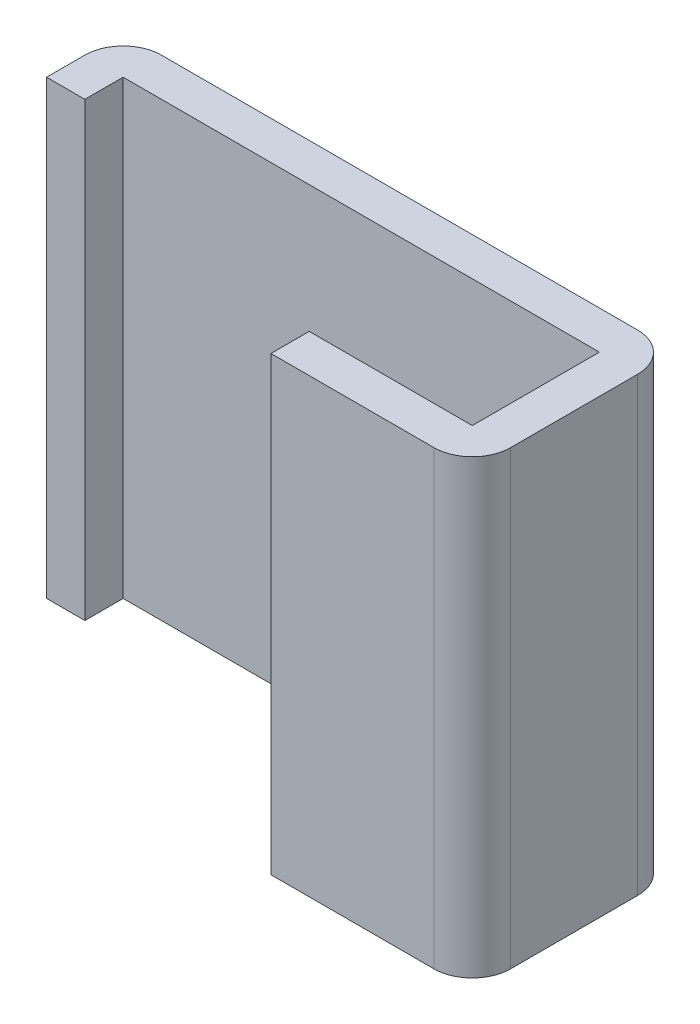
ISO-10303-21;
HEADER;
FILE_DESCRIPTION(('STEP AP214'),'2;1');
FILE_NAME('part.step','',(''),(''),'','','');
FILE_SCHEMA(('AUTOMOTIVE_DESIGN { 1 0 10303 214 1 1 1 1 }'));
ENDSEC;
DATA;
#1=APPLICATION_CONTEXT('core data for automotive mechanical design processes');
#2=APPLICATION_PROTOCOL_DEFINITION('international standard','automotive_design',2000,#1);
#3=PRODUCT_CONTEXT('',#1,'mechanical');
#4=PRODUCT('Part','Part','',(#3));
#5=PRODUCT_RELATED_PRODUCT_CATEGORY('part','',(#4));
#6=PRODUCT_DEFINITION_FORMATION('','',#4);
#7=PRODUCT_DEFINITION_CONTEXT('part definition',#1,'design');
#8=PRODUCT_DEFINITION('design','',#6,#7);
#9=PRODUCT_DEFINITION_SHAPE('','',#8);
#10=(LENGTH_UNIT() NAMED_UNIT(*) SI_UNIT(.MILLI.,.METRE.));
#11=(NAMED_UNIT(*) PLANE_ANGLE_UNIT() SI_UNIT($,.RADIAN.));
#12=(NAMED_UNIT(*) SI_UNIT($,.STERADIAN.) SOLID_ANGLE_UNIT());
#13=UNCERTAINTY_MEASURE_WITH_UNIT(LENGTH_MEASURE(1.E-05),#10,'distance_accuracy_value','');
#14=(GEOMETRIC_REPRESENTATION_CONTEXT(3) GLOBAL_UNCERTAINTY_ASSIGNED_CONTEXT((#13)) GLOBAL_UNIT_ASSIGNED_CONTEXT((#10,
#11,#12)) REPRESENTATION_CONTEXT('',''));
#15=CARTESIAN_POINT('',(0.,0.,0.));
#16=DIRECTION('',(0.,0.,1.));
#17=DIRECTION('',(1.,0.,0.));
#18=AXIS2_PLACEMENT_3D('',#15,#16,#17);
#19=CARTESIAN_POINT('',(0.49,-9.094,1.08));
#20=DIRECTION('',(1.,0.,0.));
#21=DIRECTION('',(0.,0.,-1.));
#22=AXIS2_PLACEMENT_3D('',#19,#20,#21);
#23=PLANE('',#22);
#24=DIRECTION('',(0.,1.,0.));
#25=VECTOR('',#24,1.);
#26=CARTESIAN_POINT('',(0.49,-9.094,1.33));
#27=LINE('',#26,#25);
#28=CARTESIAN_POINT('',(0.49,-6.146,1.33));
#29=VERTEX_POINT('',#28);
#30=CARTESIAN_POINT('',(0.49,-9.094,1.33));
#31=VERTEX_POINT('',#30);
#32=EDGE_CURVE('E98',#29,#31,#27,.F.);
#33=ORIENTED_EDGE('',*,*,#32,.F.);
#34=DIRECTION('',(0.,0.,-1.));
#35=VECTOR('',#34,1.);
#36=CARTESIAN_POINT('',(0.49,-6.146,1.08));
#37=LINE('',#36,#35);
#38=CARTESIAN_POINT('',(0.49,-6.146,1.08));
#39=VERTEX_POINT('',#38);
#40=EDGE_CURVE('E103',#39,#29,#37,.F.);
#41=ORIENTED_EDGE('',*,*,#40,.F.);
#42=DIRECTION('',(0.,1.,0.));
#43=VECTOR('',#42,1.);
#44=CARTESIAN_POINT('',(0.49,-9.094,1.08));
#45=LINE('',#44,#43);
#46=CARTESIAN_POINT('',(0.49,-9.094,1.08));
#47=VERTEX_POINT('',#46);
#48=EDGE_CURVE('E127',#39,#47,#45,.F.);
#49=ORIENTED_EDGE('',*,*,#48,.T.);
#50=DIRECTION('',(0.,0.,-1.));
#51=VECTOR('',#50,1.);
#52=CARTESIAN_POINT('',(0.49,-9.094,1.08));
#53=LINE('',#52,#51);
#54=EDGE_CURVE('E84',#31,#47,#53,.T.);
#55=ORIENTED_EDGE('',*,*,#54,.F.);
#56=EDGE_LOOP('',(#33,#41,#49,#55));
#57=FACE_BOUND('',#56,.T.);
#58=ADVANCED_FACE('F17',(#57),#23,.F.);
#59=CARTESIAN_POINT('',(1.555,-9.094,1.33));
#60=DIRECTION('',(0.,0.,1.));
#61=DIRECTION('',(1.,0.,0.));
#62=AXIS2_PLACEMENT_3D('',#59,#60,#61);
#63=PLANE('',#62);
#64=ORIENTED_EDGE('',*,*,#32,.T.);
#65=DIRECTION('',(1.,0.,0.));
#66=VECTOR('',#65,1.);
#67=CARTESIAN_POINT('',(1.555,-9.094,1.33));
#68=LINE('',#67,#66);
#69=CARTESIAN_POINT('',(1.555,-9.094,1.33));
#70=VERTEX_POINT('',#69);
#71=EDGE_CURVE('E78',#31,#70,#68,.T.);
#72=ORIENTED_EDGE('',*,*,#71,.T.);
#73=DIRECTION('',(0.,-1.,0.));
#74=VECTOR('',#73,1.);
#75=CARTESIAN_POINT('',(1.555,-9.094,1.33));
#76=LINE('',#75,#74);
#77=CARTESIAN_POINT('',(1.555,-6.146,1.33));
#78=VERTEX_POINT('',#77);
#79=EDGE_CURVE('E99',#78,#70,#76,.T.);
#80=ORIENTED_EDGE('',*,*,#79,.F.);
#81=DIRECTION('',(1.,0.,0.));
#82=VECTOR('',#81,1.);
#83=CARTESIAN_POINT('',(1.555,-6.146,1.33));
#84=LINE('',#83,#82);
#85=EDGE_CURVE('E94',#78,#29,#84,.F.);
#86=ORIENTED_EDGE('',*,*,#85,.T.);
#87=EDGE_LOOP('',(#64,#72,#80,#86));
#88=FACE_BOUND('',#87,.T.);
#89=ADVANCED_FACE('F96',(#88),#63,.T.);
#90=CARTESIAN_POINT('',(1.555,-9.094,1.08));
#91=DIRECTION('',(0.,0.,1.));
#92=DIRECTION('',(1.,0.,0.));
#93=AXIS2_PLACEMENT_3D('',#90,#91,#92);
#94=PLANE('',#93);
#95=ORIENTED_EDGE('',*,*,#48,.F.);
#96=DIRECTION('',(1.,0.,0.));
#97=VECTOR('',#96,1.);
#98=CARTESIAN_POINT('',(1.555,-6.146,1.08));
#99=LINE('',#98,#97);
#100=CARTESIAN_POINT('',(1.555,-6.146,1.08));
#101=VERTEX_POINT('',#100);
#102=EDGE_CURVE('E108',#101,#39,#99,.F.);
#103=ORIENTED_EDGE('',*,*,#102,.F.);
#104=DIRECTION('',(0.,1.,0.));
#105=VECTOR('',#104,1.);
#106=CARTESIAN_POINT('',(1.555,-9.094,1.08));
#107=LINE('',#106,#105);
#108=CARTESIAN_POINT('',(1.555,-9.094,1.08));
#109=VERTEX_POINT('',#108);
#110=EDGE_CURVE('E181',#101,#109,#107,.F.);
#111=ORIENTED_EDGE('',*,*,#110,.T.);
#112=DIRECTION('',(1.,0.,0.));
#113=VECTOR('',#112,1.);
#114=CARTESIAN_POINT('',(1.555,-9.094,1.08));
#115=LINE('',#114,#113);
#116=EDGE_CURVE('E125',#47,#109,#115,.T.);
#117=ORIENTED_EDGE('',*,*,#116,.F.);
#118=EDGE_LOOP('',(#95,#103,#111,#117));
#119=FACE_BOUND('',#118,.T.);
#120=ADVANCED_FACE('F379',(#119),#94,.F.);
#121=CARTESIAN_POINT('',(1.555,-9.094,1.08));
#122=DIRECTION('',(0.,-1.,0.));
#123=DIRECTION('',(0.,0.,-1.));
#124=AXIS2_PLACEMENT_3D('',#121,#122,#123);
#125=CYLINDRICAL_SURFACE('',#124,0.25);
#126=CARTESIAN_POINT('',(1.555,-6.146,1.08));
#127=DIRECTION('',(0.,-1.,0.));
#128=DIRECTION('',(0.,0.,-1.));
#129=AXIS2_PLACEMENT_3D('',#126,#127,#128);
#130=CIRCLE('',#129,0.25);
#131=CARTESIAN_POINT('',(1.805,-6.146,1.08));
#132=VERTEX_POINT('',#131);
#133=EDGE_CURVE('E147',#132,#78,#130,.T.);
#134=ORIENTED_EDGE('',*,*,#133,.T.);
#135=ORIENTED_EDGE('',*,*,#79,.T.);
#136=CARTESIAN_POINT('',(1.555,-9.094,1.08));
#137=DIRECTION('',(0.,-1.,0.));
#138=DIRECTION('',(0.,0.,-1.));
#139=AXIS2_PLACEMENT_3D('',#136,#137,#138);
#140=CIRCLE('',#139,0.25);
#141=CARTESIAN_POINT('',(1.805,-9.094,1.08));
#142=VERTEX_POINT('',#141);
#143=EDGE_CURVE('E20',#70,#142,#140,.F.);
#144=ORIENTED_EDGE('',*,*,#143,.T.);
#145=DIRECTION('',(0.,1.,0.));
#146=VECTOR('',#145,1.);
#147=CARTESIAN_POINT('',(1.805,-9.094,1.08));
#148=LINE('',#147,#146);
#149=EDGE_CURVE('E156',#142,#132,#148,.T.);
#150=ORIENTED_EDGE('',*,*,#149,.T.);
#151=EDGE_LOOP('',(#134,#135,#144,#150));
#152=FACE_BOUND('',#151,.T.);
#153=ADVANCED_FACE('F155',(#152),#125,.T.);
#154=CARTESIAN_POINT('',(-1.805,-9.094,0.5));
#155=DIRECTION('',(0.,0.,-1.));
#156=DIRECTION('',(-1.,0.,0.));
#157=AXIS2_PLACEMENT_3D('',#154,#155,#156);
#158=PLANE('',#157);
#159=DIRECTION('',(0.,1.,0.));
#160=VECTOR('',#159,1.);
#161=CARTESIAN_POINT('',(-1.555,-9.094,0.5));
#162=LINE('',#161,#160);
#163=CARTESIAN_POINT('',(-1.555,-9.094,0.5));
#164=VERTEX_POINT('',#163);
#165=CARTESIAN_POINT('',(-1.555,-6.146,0.5));
#166=VERTEX_POINT('',#165);
#167=EDGE_CURVE('E194',#164,#166,#162,.T.);
#168=ORIENTED_EDGE('',*,*,#167,.T.);
#169=DIRECTION('',(-1.,0.,0.));
#170=VECTOR('',#169,1.);
#171=CARTESIAN_POINT('',(-1.805,-6.146,0.5));
#172=LINE('',#171,#170);
#173=CARTESIAN_POINT('',(-1.805,-6.146,0.5));
#174=VERTEX_POINT('',#173);
#175=EDGE_CURVE('E150',#174,#166,#172,.F.);
#176=ORIENTED_EDGE('',*,*,#175,.F.);
#177=DIRECTION('',(0.,1.,0.));
#178=VECTOR('',#177,1.);
#179=CARTESIAN_POINT('',(-1.805,-9.094,0.5));
#180=LINE('',#179,#178);
#181=CARTESIAN_POINT('',(-1.805,-9.094,0.5));
#182=VERTEX_POINT('',#181);
#183=EDGE_CURVE('E171',#174,#182,#180,.F.);
#184=ORIENTED_EDGE('',*,*,#183,.T.);
#185=DIRECTION('',(-1.,0.,0.));
#186=VECTOR('',#185,1.);
#187=CARTESIAN_POINT('',(-1.805,-9.094,0.5));
#188=LINE('',#187,#186);
#189=EDGE_CURVE('E189',#164,#182,#188,.T.);
#190=ORIENTED_EDGE('',*,*,#189,.F.);
#191=EDGE_LOOP('',(#168,#176,#184,#190));
#192=FACE_BOUND('',#191,.T.);
#193=ADVANCED_FACE('F278',(#192),#158,.F.);
#194=CARTESIAN_POINT('',(-1.555,-9.094,0.5));
#195=DIRECTION('',(-1.,0.,0.));
#196=DIRECTION('',(0.,0.,1.));
#197=AXIS2_PLACEMENT_3D('',#194,#195,#196);
#198=PLANE('',#197);
#199=DIRECTION('',(0.,1.,0.));
#200=VECTOR('',#199,1.);
#201=CARTESIAN_POINT('',(-1.555,-9.094,0.25));
#202=LINE('',#201,#200);
#203=CARTESIAN_POINT('',(-1.555,-9.094,0.25));
#204=VERTEX_POINT('',#203);
#205=CARTESIAN_POINT('',(-1.555,-6.146,0.25));
#206=VERTEX_POINT('',#205);
#207=EDGE_CURVE('E222',#204,#206,#202,.T.);
#208=ORIENTED_EDGE('',*,*,#207,.T.);
#209=DIRECTION('',(0.,0.,1.));
#210=VECTOR('',#209,1.);
#211=CARTESIAN_POINT('',(-1.555,-6.146,0.5));
#212=LINE('',#211,#210);
#213=EDGE_CURVE('E199',#166,#206,#212,.F.);
#214=ORIENTED_EDGE('',*,*,#213,.F.);
#215=ORIENTED_EDGE('',*,*,#167,.F.);
#216=DIRECTION('',(0.,0.,1.));
#217=VECTOR('',#216,1.);
#218=CARTESIAN_POINT('',(-1.555,-9.094,0.5));
#219=LINE('',#218,#217);
#220=EDGE_CURVE('E186',#204,#164,#219,.T.);
#221=ORIENTED_EDGE('',*,*,#220,.F.);
#222=EDGE_LOOP('',(#208,#214,#215,#221));
#223=FACE_BOUND('',#222,.T.);
#224=ADVANCED_FACE('F223',(#223),#198,.F.);
#225=CARTESIAN_POINT('',(1.555,-9.094,0.25));
#226=DIRECTION('',(1.,0.,0.));
#227=DIRECTION('',(0.,0.,-1.));
#228=AXIS2_PLACEMENT_3D('',#225,#226,#227);
#229=PLANE('',#228);
#230=ORIENTED_EDGE('',*,*,#110,.F.);
#231=DIRECTION('',(0.,0.,-1.));
#232=VECTOR('',#231,1.);
#233=CARTESIAN_POINT('',(1.555,-6.146,0.25));
#234=LINE('',#233,#232);
#235=CARTESIAN_POINT('',(1.555,-6.146,0.25));
#236=VERTEX_POINT('',#235);
#237=EDGE_CURVE('E184',#236,#101,#234,.F.);
#238=ORIENTED_EDGE('',*,*,#237,.F.);
#239=DIRECTION('',(0.,1.,0.));
#240=VECTOR('',#239,1.);
#241=CARTESIAN_POINT('',(1.555,-9.094,0.25));
#242=LINE('',#241,#240);
#243=CARTESIAN_POINT('',(1.555,-9.094,0.25));
#244=VERTEX_POINT('',#243);
#245=EDGE_CURVE('E227',#236,#244,#242,.F.);
#246=ORIENTED_EDGE('',*,*,#245,.T.);
#247=DIRECTION('',(0.,0.,-1.));
#248=VECTOR('',#247,1.);
#249=CARTESIAN_POINT('',(1.555,-9.094,0.25));
#250=LINE('',#249,#248);
#251=EDGE_CURVE('E166',#109,#244,#250,.T.);
#252=ORIENTED_EDGE('',*,*,#251,.F.);
#253=EDGE_LOOP('',(#230,#238,#246,#252));
#254=FACE_BOUND('',#253,.T.);
#255=ADVANCED_FACE('F349',(#254),#229,.F.);
#256=CARTESIAN_POINT('',(1.805,-9.094,1.08));
#257=DIRECTION('',(-1.,0.,0.));
#258=DIRECTION('',(0.,0.,1.));
#259=AXIS2_PLACEMENT_3D('',#256,#257,#258);
#260=PLANE('',#259);
#261=DIRECTION('',(0.,-1.,0.));
#262=VECTOR('',#261,1.);
#263=CARTESIAN_POINT('',(1.805,-9.094,0.25));
#264=LINE('',#263,#262);
#265=CARTESIAN_POINT('',(1.805,-6.146,0.25));
#266=VERTEX_POINT('',#265);
#267=CARTESIAN_POINT('',(1.805,-9.094,0.25));
#268=VERTEX_POINT('',#267);
#269=EDGE_CURVE('E146',#266,#268,#264,.T.);
#270=ORIENTED_EDGE('',*,*,#269,.F.);
#271=DIRECTION('',(0.,0.,1.));
#272=VECTOR('',#271,1.);
#273=CARTESIAN_POINT('',(1.805,-6.146,1.08));
#274=LINE('',#273,#272);
#275=EDGE_CURVE('E165',#132,#266,#274,.F.);
#276=ORIENTED_EDGE('',*,*,#275,.F.);
#277=ORIENTED_EDGE('',*,*,#149,.F.);
#278=DIRECTION('',(0.,0.,1.));
#279=VECTOR('',#278,1.);
#280=CARTESIAN_POINT('',(1.805,-9.094,1.08));
#281=LINE('',#280,#279);
#282=EDGE_CURVE('E163',#268,#142,#281,.T.);
#283=ORIENTED_EDGE('',*,*,#282,.F.);
#284=EDGE_LOOP('',(#270,#276,#277,#283));
#285=FACE_BOUND('',#284,.T.);
#286=ADVANCED_FACE('F162',(#285),#260,.F.);
#287=CARTESIAN_POINT('',(-1.805,-9.094,0.25));
#288=DIRECTION('',(1.,0.,0.));
#289=DIRECTION('',(0.,0.,-1.));
#290=AXIS2_PLACEMENT_3D('',#287,#288,#289);
#291=PLANE('',#290);
#292=ORIENTED_EDGE('',*,*,#183,.F.);
#293=DIRECTION('',(0.,0.,1.));
#294=VECTOR('',#293,1.);
#295=CARTESIAN_POINT('',(-1.805,-6.146,0.25));
#296=LINE('',#295,#294);
#297=CARTESIAN_POINT('',(-1.805,-6.146,0.25));
#298=VERTEX_POINT('',#297);
#299=EDGE_CURVE('E145',#298,#174,#296,.T.);
#300=ORIENTED_EDGE('',*,*,#299,.F.);
#301=DIRECTION('',(0.,-1.,0.));
#302=VECTOR('',#301,1.);
#303=CARTESIAN_POINT('',(-1.805,-9.094,0.25));
#304=LINE('',#303,#302);
#305=CARTESIAN_POINT('',(-1.805,-9.094,0.25));
#306=VERTEX_POINT('',#305);
#307=EDGE_CURVE('E143',#306,#298,#304,.F.);
#308=ORIENTED_EDGE('',*,*,#307,.F.);
#309=DIRECTION('',(0.,0.,-1.));
#310=VECTOR('',#309,1.);
#311=CARTESIAN_POINT('',(-1.805,-9.094,0.25));
#312=LINE('',#311,#310);
#313=EDGE_CURVE('E174',#182,#306,#312,.T.);
#314=ORIENTED_EDGE('',*,*,#313,.F.);
#315=EDGE_LOOP('',(#292,#300,#308,#314));
#316=FACE_BOUND('',#315,.T.);
#317=ADVANCED_FACE('F252',(#316),#291,.F.);
#318=CARTESIAN_POINT('',(-1.555,-9.094,0.25));
#319=DIRECTION('',(0.,0.,-1.));
#320=DIRECTION('',(-1.,0.,0.));
#321=AXIS2_PLACEMENT_3D('',#318,#319,#320);
#322=PLANE('',#321);
#323=ORIENTED_EDGE('',*,*,#245,.F.);
#324=DIRECTION('',(1.,0.,0.));
#325=VECTOR('',#324,1.);
#326=CARTESIAN_POINT('',(1.555,-6.146,0.25));
#327=LINE('',#326,#325);
#328=EDGE_CURVE('E213',#206,#236,#327,.T.);
#329=ORIENTED_EDGE('',*,*,#328,.F.);
#330=ORIENTED_EDGE('',*,*,#207,.F.);
#331=DIRECTION('',(1.,0.,0.));
#332=VECTOR('',#331,1.);
#333=CARTESIAN_POINT('',(1.555,-9.094,0.25));
#334=LINE('',#333,#332);
#335=EDGE_CURVE('E137',#204,#244,#334,.T.);
#336=ORIENTED_EDGE('',*,*,#335,.T.);
#337=EDGE_LOOP('',(#323,#329,#330,#336));
#338=FACE_BOUND('',#337,.T.);
#339=ADVANCED_FACE('F230',(#338),#322,.F.);
#340=CARTESIAN_POINT('',(1.555,-9.094,0.25));
#341=DIRECTION('',(0.,-1.,0.));
#342=DIRECTION('',(0.,0.,-1.));
#343=AXIS2_PLACEMENT_3D('',#340,#341,#342);
#344=CYLINDRICAL_SURFACE('',#343,0.25);
#345=CARTESIAN_POINT('',(1.555,-6.146,0.25));
#346=DIRECTION('',(0.,-1.,0.));
#347=DIRECTION('',(0.,0.,-1.));
#348=AXIS2_PLACEMENT_3D('',#345,#346,#347);
#349=CIRCLE('',#348,0.25);
#350=CARTESIAN_POINT('',(1.555,-6.146,0.));
#351=VERTEX_POINT('',#350);
#352=EDGE_CURVE('E144',#266,#351,#349,.F.);
#353=ORIENTED_EDGE('',*,*,#352,.F.);
#354=ORIENTED_EDGE('',*,*,#269,.T.);
#355=CARTESIAN_POINT('',(1.555,-9.094,0.25));
#356=DIRECTION('',(0.,-1.,0.));
#357=DIRECTION('',(0.,0.,-1.));
#358=AXIS2_PLACEMENT_3D('',#355,#356,#357);
#359=CIRCLE('',#358,0.25);
#360=CARTESIAN_POINT('',(1.555,-9.094,0.));
#361=VERTEX_POINT('',#360);
#362=EDGE_CURVE('E138',#268,#361,#359,.F.);
#363=ORIENTED_EDGE('',*,*,#362,.T.);
#364=DIRECTION('',(0.,1.,0.));
#365=VECTOR('',#364,1.);
#366=CARTESIAN_POINT('',(1.555,-9.094,0.));
#367=LINE('',#366,#365);
#368=EDGE_CURVE('E262',#361,#351,#367,.T.);
#369=ORIENTED_EDGE('',*,*,#368,.T.);
#370=EDGE_LOOP('',(#353,#354,#363,#369));
#371=FACE_BOUND('',#370,.T.);
#372=ADVANCED_FACE('F280',(#371),#344,.T.);
#373=CARTESIAN_POINT('',(1.555,-6.146,0.25));
#374=DIRECTION('',(0.,1.,0.));
#375=DIRECTION('',(0.,0.,1.));
#376=AXIS2_PLACEMENT_3D('',#373,#374,#375);
#377=PLANE('',#376);
#378=ORIENTED_EDGE('',*,*,#213,.T.);
#379=ORIENTED_EDGE('',*,*,#328,.T.);
#380=ORIENTED_EDGE('',*,*,#237,.T.);
#381=ORIENTED_EDGE('',*,*,#102,.T.);
#382=ORIENTED_EDGE('',*,*,#40,.T.);
#383=ORIENTED_EDGE('',*,*,#85,.F.);
#384=ORIENTED_EDGE('',*,*,#133,.F.);
#385=ORIENTED_EDGE('',*,*,#275,.T.);
#386=ORIENTED_EDGE('',*,*,#352,.T.);
#387=DIRECTION('',(1.,0.,0.));
#388=VECTOR('',#387,1.);
#389=CARTESIAN_POINT('',(1.555,-6.146,0.));
#390=LINE('',#389,#388);
#391=CARTESIAN_POINT('',(-1.555,-6.146,0.));
#392=VERTEX_POINT('',#391);
#393=EDGE_CURVE('E236',#351,#392,#390,.F.);
#394=ORIENTED_EDGE('',*,*,#393,.T.);
#395=CARTESIAN_POINT('',(-1.555,-6.146,0.25));
#396=DIRECTION('',(0.,-1.,0.));
#397=DIRECTION('',(0.,0.,-1.));
#398=AXIS2_PLACEMENT_3D('',#395,#396,#397);
#399=CIRCLE('',#398,0.25);
#400=EDGE_CURVE('E141',#298,#392,#399,.T.);
#401=ORIENTED_EDGE('',*,*,#400,.F.);
#402=ORIENTED_EDGE('',*,*,#299,.T.);
#403=ORIENTED_EDGE('',*,*,#175,.T.);
#404=EDGE_LOOP('',(#378,#379,#380,#381,#382,#383,#384,#385,#386,#394,#401,#402,#403));
#405=FACE_BOUND('',#404,.T.);
#406=ADVANCED_FACE('F105',(#405),#377,.T.);
#407=CARTESIAN_POINT('',(-1.555,-9.094,0.25));
#408=DIRECTION('',(0.,-1.,0.));
#409=DIRECTION('',(0.,0.,-1.));
#410=AXIS2_PLACEMENT_3D('',#407,#408,#409);
#411=CYLINDRICAL_SURFACE('',#410,0.25);
#412=ORIENTED_EDGE('',*,*,#400,.T.);
#413=DIRECTION('',(0.,1.,0.));
#414=VECTOR('',#413,1.);
#415=CARTESIAN_POINT('',(-1.555,-9.094,0.));
#416=LINE('',#415,#414);
#417=CARTESIAN_POINT('',(-1.555,-9.094,0.));
#418=VERTEX_POINT('',#417);
#419=EDGE_CURVE('E26',#392,#418,#416,.F.);
#420=ORIENTED_EDGE('',*,*,#419,.T.);
#421=CARTESIAN_POINT('',(-1.555,-9.094,0.25));
#422=DIRECTION('',(0.,-1.,0.));
#423=DIRECTION('',(0.,0.,-1.));
#424=AXIS2_PLACEMENT_3D('',#421,#422,#423);
#425=CIRCLE('',#424,0.25);
#426=EDGE_CURVE('E34',#418,#306,#425,.F.);
#427=ORIENTED_EDGE('',*,*,#426,.T.);
#428=ORIENTED_EDGE('',*,*,#307,.T.);
#429=EDGE_LOOP('',(#412,#420,#427,#428));
#430=FACE_BOUND('',#429,.T.);
#431=ADVANCED_FACE('F256',(#430),#411,.T.);
#432=CARTESIAN_POINT('',(1.555,-9.094,0.25));
#433=DIRECTION('',(0.,1.,0.));
#434=DIRECTION('',(0.,0.,1.));
#435=AXIS2_PLACEMENT_3D('',#432,#433,#434);
#436=PLANE('',#435);
#437=ORIENTED_EDGE('',*,*,#220,.T.);
#438=ORIENTED_EDGE('',*,*,#189,.T.);
#439=ORIENTED_EDGE('',*,*,#313,.T.);
#440=ORIENTED_EDGE('',*,*,#426,.F.);
#441=DIRECTION('',(1.,0.,0.));
#442=VECTOR('',#441,1.);
#443=CARTESIAN_POINT('',(1.555,-9.094,0.));
#444=LINE('',#443,#442);
#445=EDGE_CURVE('E11',#418,#361,#444,.T.);
#446=ORIENTED_EDGE('',*,*,#445,.T.);
#447=ORIENTED_EDGE('',*,*,#362,.F.);
#448=ORIENTED_EDGE('',*,*,#282,.T.);
#449=ORIENTED_EDGE('',*,*,#143,.F.);
#450=ORIENTED_EDGE('',*,*,#71,.F.);
#451=ORIENTED_EDGE('',*,*,#54,.T.);
#452=ORIENTED_EDGE('',*,*,#116,.T.);
#453=ORIENTED_EDGE('',*,*,#251,.T.);
#454=ORIENTED_EDGE('',*,*,#335,.F.);
#455=EDGE_LOOP('',(#437,#438,#439,#440,#446,#447,#448,#449,#450,#451,#452,#453,#454));
#456=FACE_BOUND('',#455,.T.);
#457=ADVANCED_FACE('F170',(#456),#436,.F.);
#458=CARTESIAN_POINT('',(1.555,-9.094,0.));
#459=DIRECTION('',(0.,0.,1.));
#460=DIRECTION('',(1.,0.,0.));
#461=AXIS2_PLACEMENT_3D('',#458,#459,#460);
#462=PLANE('',#461);
#463=ORIENTED_EDGE('',*,*,#419,.F.);
#464=ORIENTED_EDGE('',*,*,#393,.F.);
#465=ORIENTED_EDGE('',*,*,#368,.F.);
#466=ORIENTED_EDGE('',*,*,#445,.F.);
#467=EDGE_LOOP('',(#463,#464,#465,#466));
#468=FACE_BOUND('',#467,.T.);
#469=ADVANCED_FACE('F279',(#468),#462,.F.);
#470=CLOSED_SHELL('',(#58,#89,#120,#153,#193,#224,#255,#286,#317,#339,#372,#406,#431,#457,#469));
#471=MANIFOLD_SOLID_BREP('B1',#470);
#472=ADVANCED_BREP_SHAPE_REPRESENTATION('',(#18,#471),#14);
#473=SHAPE_DEFINITION_REPRESENTATION(#9,#472);
ENDSEC;
END-ISO-10303-21;
